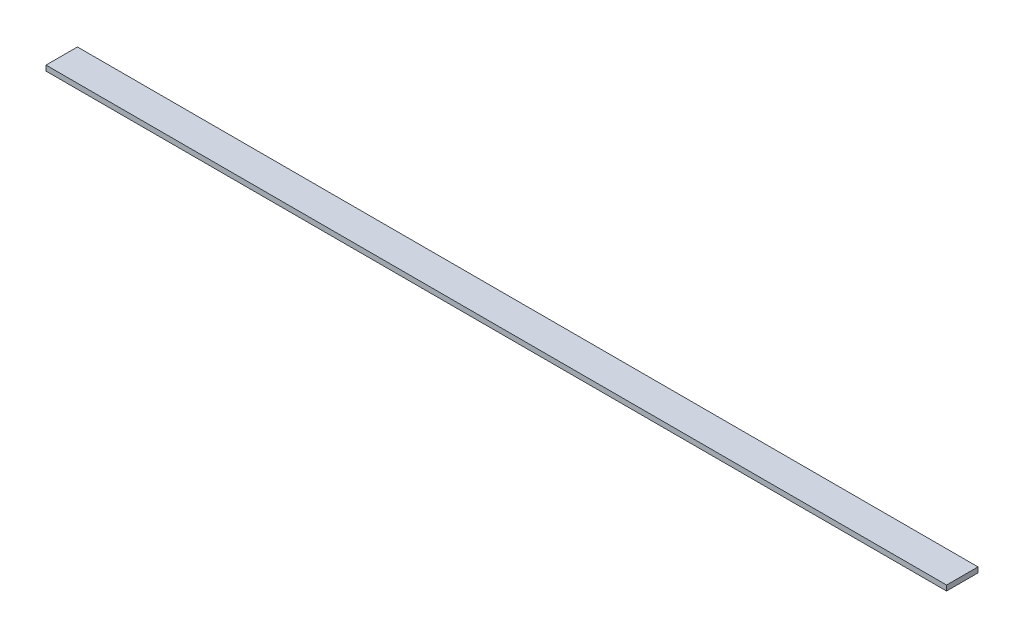
ISO-10303-21;
HEADER;
FILE_DESCRIPTION(('STEP AP214'),'2;1');
FILE_NAME('part.step','',(''),(''),'','','');
FILE_SCHEMA(('AUTOMOTIVE_DESIGN { 1 0 10303 214 1 1 1 1 }'));
ENDSEC;
DATA;
#1=APPLICATION_CONTEXT('core data for automotive mechanical design processes');
#2=APPLICATION_PROTOCOL_DEFINITION('international standard','automotive_design',2000,#1);
#3=PRODUCT_CONTEXT('',#1,'mechanical');
#4=PRODUCT('Part','Part','',(#3));
#5=PRODUCT_RELATED_PRODUCT_CATEGORY('part','',(#4));
#6=PRODUCT_DEFINITION_FORMATION('','',#4);
#7=PRODUCT_DEFINITION_CONTEXT('part definition',#1,'design');
#8=PRODUCT_DEFINITION('design','',#6,#7);
#9=PRODUCT_DEFINITION_SHAPE('','',#8);
#10=(LENGTH_UNIT() NAMED_UNIT(*) SI_UNIT(.MILLI.,.METRE.));
#11=(NAMED_UNIT(*) PLANE_ANGLE_UNIT() SI_UNIT($,.RADIAN.));
#12=(NAMED_UNIT(*) SI_UNIT($,.STERADIAN.) SOLID_ANGLE_UNIT());
#13=UNCERTAINTY_MEASURE_WITH_UNIT(LENGTH_MEASURE(1.E-05),#10,'distance_accuracy_value','');
#14=(GEOMETRIC_REPRESENTATION_CONTEXT(3) GLOBAL_UNCERTAINTY_ASSIGNED_CONTEXT((#13)) GLOBAL_UNIT_ASSIGNED_CONTEXT((#10,
#11,#12)) REPRESENTATION_CONTEXT('',''));
#15=CARTESIAN_POINT('',(0.,0.,0.));
#16=DIRECTION('',(0.,0.,1.));
#17=DIRECTION('',(1.,0.,0.));
#18=AXIS2_PLACEMENT_3D('',#15,#16,#17);
#19=CARTESIAN_POINT('',(136.525,1.5875,-4.7625));
#20=DIRECTION('',(-1.,0.,0.));
#21=DIRECTION('',(0.,0.,1.));
#22=AXIS2_PLACEMENT_3D('',#19,#20,#21);
#23=PLANE('',#22);
#24=DIRECTION('',(0.,0.,-1.));
#25=VECTOR('',#24,1.);
#26=CARTESIAN_POINT('',(136.525,0.,-4.7625));
#27=LINE('',#26,#25);
#28=CARTESIAN_POINT('',(136.525,0.,4.7625));
#29=VERTEX_POINT('',#28);
#30=CARTESIAN_POINT('',(136.525,0.,-4.7625));
#31=VERTEX_POINT('',#30);
#32=EDGE_CURVE('E98',#29,#31,#27,.T.);
#33=ORIENTED_EDGE('',*,*,#32,.T.);
#34=DIRECTION('',(0.,-1.,0.));
#35=VECTOR('',#34,1.);
#36=CARTESIAN_POINT('',(136.525,1.5875,-4.7625));
#37=LINE('',#36,#35);
#38=CARTESIAN_POINT('',(136.525,1.5875,-4.7625));
#39=VERTEX_POINT('',#38);
#40=EDGE_CURVE('E11',#39,#31,#37,.T.);
#41=ORIENTED_EDGE('',*,*,#40,.F.);
#42=DIRECTION('',(0.,0.,-1.));
#43=VECTOR('',#42,1.);
#44=CARTESIAN_POINT('',(136.525,1.5875,-4.7625));
#45=LINE('',#44,#43);
#46=CARTESIAN_POINT('',(136.525,1.5875,4.7625));
#47=VERTEX_POINT('',#46);
#48=EDGE_CURVE('E86',#47,#39,#45,.T.);
#49=ORIENTED_EDGE('',*,*,#48,.F.);
#50=DIRECTION('',(0.,-1.,0.));
#51=VECTOR('',#50,1.);
#52=CARTESIAN_POINT('',(136.525,1.5875,4.7625));
#53=LINE('',#52,#51);
#54=EDGE_CURVE('E94',#47,#29,#53,.T.);
#55=ORIENTED_EDGE('',*,*,#54,.T.);
#56=EDGE_LOOP('',(#33,#41,#49,#55));
#57=FACE_BOUND('',#56,.T.);
#58=ADVANCED_FACE('F35',(#57),#23,.F.);
#59=CARTESIAN_POINT('',(-136.525,1.5875,-4.7625));
#60=DIRECTION('',(0.,0.,1.));
#61=DIRECTION('',(1.,0.,0.));
#62=AXIS2_PLACEMENT_3D('',#59,#60,#61);
#63=PLANE('',#62);
#64=DIRECTION('',(-1.,0.,0.));
#65=VECTOR('',#64,1.);
#66=CARTESIAN_POINT('',(-136.525,0.,-4.7625));
#67=LINE('',#66,#65);
#68=CARTESIAN_POINT('',(-136.525,0.,-4.7625));
#69=VERTEX_POINT('',#68);
#70=EDGE_CURVE('E90',#31,#69,#67,.T.);
#71=ORIENTED_EDGE('',*,*,#70,.T.);
#72=DIRECTION('',(0.,-1.,0.));
#73=VECTOR('',#72,1.);
#74=CARTESIAN_POINT('',(-136.525,1.5875,-4.7625));
#75=LINE('',#74,#73);
#76=CARTESIAN_POINT('',(-136.525,1.5875,-4.7625));
#77=VERTEX_POINT('',#76);
#78=EDGE_CURVE('E43',#77,#69,#75,.T.);
#79=ORIENTED_EDGE('',*,*,#78,.F.);
#80=DIRECTION('',(-1.,0.,0.));
#81=VECTOR('',#80,1.);
#82=CARTESIAN_POINT('',(-136.525,1.5875,-4.7625));
#83=LINE('',#82,#81);
#84=EDGE_CURVE('E81',#39,#77,#83,.T.);
#85=ORIENTED_EDGE('',*,*,#84,.F.);
#86=ORIENTED_EDGE('',*,*,#40,.T.);
#87=EDGE_LOOP('',(#71,#79,#85,#86));
#88=FACE_BOUND('',#87,.T.);
#89=ADVANCED_FACE('F89',(#88),#63,.F.);
#90=CARTESIAN_POINT('',(-136.525,1.5875,-4.7625));
#91=DIRECTION('',(1.,0.,0.));
#92=DIRECTION('',(0.,0.,-1.));
#93=AXIS2_PLACEMENT_3D('',#90,#91,#92);
#94=PLANE('',#93);
#95=DIRECTION('',(0.,0.,1.));
#96=VECTOR('',#95,1.);
#97=CARTESIAN_POINT('',(-136.525,0.,-4.7625));
#98=LINE('',#97,#96);
#99=CARTESIAN_POINT('',(-136.525,0.,4.7625));
#100=VERTEX_POINT('',#99);
#101=EDGE_CURVE('E68',#69,#100,#98,.T.);
#102=ORIENTED_EDGE('',*,*,#101,.T.);
#103=DIRECTION('',(0.,-1.,0.));
#104=VECTOR('',#103,1.);
#105=CARTESIAN_POINT('',(-136.525,1.5875,4.7625));
#106=LINE('',#105,#104);
#107=CARTESIAN_POINT('',(-136.525,1.5875,4.7625));
#108=VERTEX_POINT('',#107);
#109=EDGE_CURVE('E91',#108,#100,#106,.T.);
#110=ORIENTED_EDGE('',*,*,#109,.F.);
#111=DIRECTION('',(0.,0.,1.));
#112=VECTOR('',#111,1.);
#113=CARTESIAN_POINT('',(-136.525,1.5875,-4.7625));
#114=LINE('',#113,#112);
#115=EDGE_CURVE('E84',#77,#108,#114,.T.);
#116=ORIENTED_EDGE('',*,*,#115,.F.);
#117=ORIENTED_EDGE('',*,*,#78,.T.);
#118=EDGE_LOOP('',(#102,#110,#116,#117));
#119=FACE_BOUND('',#118,.T.);
#120=ADVANCED_FACE('F92',(#119),#94,.F.);
#121=CARTESIAN_POINT('',(-136.525,1.5875,4.7625));
#122=DIRECTION('',(0.,0.,-1.));
#123=DIRECTION('',(-1.,0.,0.));
#124=AXIS2_PLACEMENT_3D('',#121,#122,#123);
#125=PLANE('',#124);
#126=DIRECTION('',(1.,0.,0.));
#127=VECTOR('',#126,1.);
#128=CARTESIAN_POINT('',(-136.525,0.,4.7625));
#129=LINE('',#128,#127);
#130=EDGE_CURVE('E74',#100,#29,#129,.T.);
#131=ORIENTED_EDGE('',*,*,#130,.T.);
#132=ORIENTED_EDGE('',*,*,#54,.F.);
#133=DIRECTION('',(1.,0.,0.));
#134=VECTOR('',#133,1.);
#135=CARTESIAN_POINT('',(-136.525,1.5875,4.7625));
#136=LINE('',#135,#134);
#137=EDGE_CURVE('E51',#108,#47,#136,.T.);
#138=ORIENTED_EDGE('',*,*,#137,.F.);
#139=ORIENTED_EDGE('',*,*,#109,.T.);
#140=EDGE_LOOP('',(#131,#132,#138,#139));
#141=FACE_BOUND('',#140,.T.);
#142=ADVANCED_FACE('F105',(#141),#125,.F.);
#143=CARTESIAN_POINT('',(0.,1.5875,0.));
#144=DIRECTION('',(0.,1.,0.));
#145=DIRECTION('',(0.,0.,1.));
#146=AXIS2_PLACEMENT_3D('',#143,#144,#145);
#147=PLANE('',#146);
#148=ORIENTED_EDGE('',*,*,#48,.T.);
#149=ORIENTED_EDGE('',*,*,#84,.T.);
#150=ORIENTED_EDGE('',*,*,#115,.T.);
#151=ORIENTED_EDGE('',*,*,#137,.T.);
#152=EDGE_LOOP('',(#148,#149,#150,#151));
#153=FACE_BOUND('',#152,.T.);
#154=ADVANCED_FACE('F82',(#153),#147,.T.);
#155=CARTESIAN_POINT('',(0.,0.,0.));
#156=DIRECTION('',(0.,1.,0.));
#157=DIRECTION('',(0.,0.,1.));
#158=AXIS2_PLACEMENT_3D('',#155,#156,#157);
#159=PLANE('',#158);
#160=ORIENTED_EDGE('',*,*,#32,.F.);
#161=ORIENTED_EDGE('',*,*,#130,.F.);
#162=ORIENTED_EDGE('',*,*,#101,.F.);
#163=ORIENTED_EDGE('',*,*,#70,.F.);
#164=EDGE_LOOP('',(#160,#161,#162,#163));
#165=FACE_BOUND('',#164,.T.);
#166=ADVANCED_FACE('F108',(#165),#159,.F.);
#167=CLOSED_SHELL('',(#58,#89,#120,#142,#154,#166));
#168=MANIFOLD_SOLID_BREP('B2',#167);
#169=ADVANCED_BREP_SHAPE_REPRESENTATION('',(#18,#168),#14);
#170=SHAPE_DEFINITION_REPRESENTATION(#9,#169);
ENDSEC;
END-ISO-10303-21;
